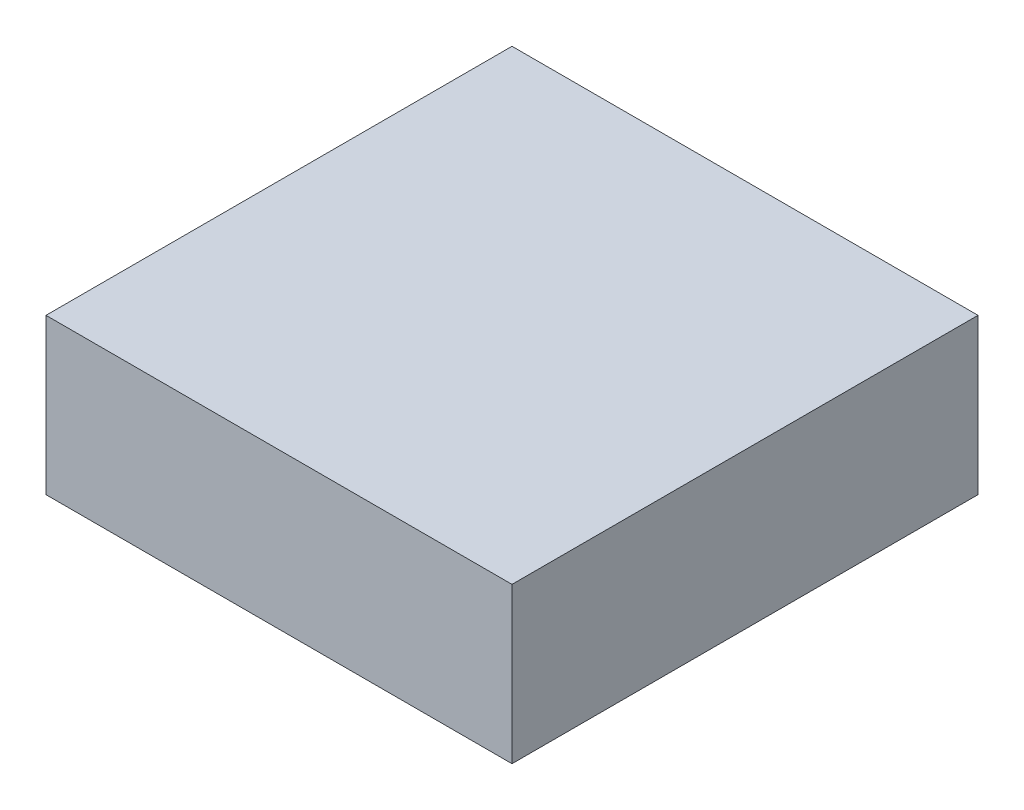
ISO-10303-21;
HEADER;
FILE_DESCRIPTION(('STEP AP214'),'2;1');
FILE_NAME('part.step','',(''),(''),'','','');
FILE_SCHEMA(('AUTOMOTIVE_DESIGN { 1 0 10303 214 1 1 1 1 }'));
ENDSEC;
DATA;
#1=APPLICATION_CONTEXT('core data for automotive mechanical design processes');
#2=APPLICATION_PROTOCOL_DEFINITION('international standard','automotive_design',2000,#1);
#3=PRODUCT_CONTEXT('',#1,'mechanical');
#4=PRODUCT('Part','Part','',(#3));
#5=PRODUCT_RELATED_PRODUCT_CATEGORY('part','',(#4));
#6=PRODUCT_DEFINITION_FORMATION('','',#4);
#7=PRODUCT_DEFINITION_CONTEXT('part definition',#1,'design');
#8=PRODUCT_DEFINITION('design','',#6,#7);
#9=PRODUCT_DEFINITION_SHAPE('','',#8);
#10=(LENGTH_UNIT() NAMED_UNIT(*) SI_UNIT(.MILLI.,.METRE.));
#11=(NAMED_UNIT(*) PLANE_ANGLE_UNIT() SI_UNIT($,.RADIAN.));
#12=(NAMED_UNIT(*) SI_UNIT($,.STERADIAN.) SOLID_ANGLE_UNIT());
#13=UNCERTAINTY_MEASURE_WITH_UNIT(LENGTH_MEASURE(1.E-05),#10,'distance_accuracy_value','');
#14=(GEOMETRIC_REPRESENTATION_CONTEXT(3) GLOBAL_UNCERTAINTY_ASSIGNED_CONTEXT((#13)) GLOBAL_UNIT_ASSIGNED_CONTEXT((#10,
#11,#12)) REPRESENTATION_CONTEXT('',''));
#15=CARTESIAN_POINT('',(0.,0.,0.));
#16=DIRECTION('',(0.,0.,1.));
#17=DIRECTION('',(1.,0.,0.));
#18=AXIS2_PLACEMENT_3D('',#15,#16,#17);
#19=CARTESIAN_POINT('',(-0.67499992,-0.22499828,0.));
#20=DIRECTION('',(0.,1.,0.));
#21=DIRECTION('',(1.,0.,0.));
#22=AXIS2_PLACEMENT_3D('',#19,#20,#21);
#23=PLANE('',#22);
#24=DIRECTION('',(1.,0.,0.));
#25=VECTOR('',#24,1.);
#26=CARTESIAN_POINT('',(-0.67499992,-0.22499828,0.));
#27=LINE('',#26,#25);
#28=CARTESIAN_POINT('',(-0.67499992,-0.22499828,0.));
#29=VERTEX_POINT('',#28);
#30=CARTESIAN_POINT('',(0.67499992,-0.22499828,0.));
#31=VERTEX_POINT('',#30);
#32=EDGE_CURVE('E11',#29,#31,#27,.T.);
#33=ORIENTED_EDGE('',*,*,#32,.T.);
#34=DIRECTION('',(0.,0.,1.));
#35=VECTOR('',#34,1.);
#36=CARTESIAN_POINT('',(0.67499992,-0.22499828,0.));
#37=LINE('',#36,#35);
#38=CARTESIAN_POINT('',(0.67499992,-0.22499828,1.34999984));
#39=VERTEX_POINT('',#38);
#40=EDGE_CURVE('E27',#31,#39,#37,.T.);
#41=ORIENTED_EDGE('',*,*,#40,.T.);
#42=DIRECTION('',(1.,0.,0.));
#43=VECTOR('',#42,1.);
#44=CARTESIAN_POINT('',(-0.67499992,-0.22499828,1.34999984));
#45=LINE('',#44,#43);
#46=CARTESIAN_POINT('',(-0.67499992,-0.22499828,1.34999984));
#47=VERTEX_POINT('',#46);
#48=EDGE_CURVE('E20',#47,#39,#45,.T.);
#49=ORIENTED_EDGE('',*,*,#48,.F.);
#50=DIRECTION('',(0.,0.,1.));
#51=VECTOR('',#50,1.);
#52=CARTESIAN_POINT('',(-0.67499992,-0.22499828,0.));
#53=LINE('',#52,#51);
#54=EDGE_CURVE('E77',#29,#47,#53,.T.);
#55=ORIENTED_EDGE('',*,*,#54,.F.);
#56=EDGE_LOOP('',(#33,#41,#49,#55));
#57=FACE_BOUND('',#56,.T.);
#58=ADVANCED_FACE('F17',(#57),#23,.F.);
#59=CARTESIAN_POINT('',(0.67499992,-0.22499828,0.));
#60=DIRECTION('',(-1.,0.,0.));
#61=DIRECTION('',(0.,0.,1.));
#62=AXIS2_PLACEMENT_3D('',#59,#60,#61);
#63=PLANE('',#62);
#64=DIRECTION('',(0.,1.,0.));
#65=VECTOR('',#64,1.);
#66=CARTESIAN_POINT('',(0.67499992,-0.22499828,0.));
#67=LINE('',#66,#65);
#68=CARTESIAN_POINT('',(0.67499992,0.22500082,0.));
#69=VERTEX_POINT('',#68);
#70=EDGE_CURVE('E104',#31,#69,#67,.T.);
#71=ORIENTED_EDGE('',*,*,#70,.T.);
#72=DIRECTION('',(0.,0.,1.));
#73=VECTOR('',#72,1.);
#74=CARTESIAN_POINT('',(0.67499992,0.22500082,0.));
#75=LINE('',#74,#73);
#76=CARTESIAN_POINT('',(0.67499992,0.22500082,1.34999984));
#77=VERTEX_POINT('',#76);
#78=EDGE_CURVE('E102',#69,#77,#75,.T.);
#79=ORIENTED_EDGE('',*,*,#78,.T.);
#80=DIRECTION('',(0.,1.,0.));
#81=VECTOR('',#80,1.);
#82=CARTESIAN_POINT('',(0.67499992,-0.22499828,1.34999984));
#83=LINE('',#82,#81);
#84=EDGE_CURVE('E53',#39,#77,#83,.T.);
#85=ORIENTED_EDGE('',*,*,#84,.F.);
#86=ORIENTED_EDGE('',*,*,#40,.F.);
#87=EDGE_LOOP('',(#71,#79,#85,#86));
#88=FACE_BOUND('',#87,.T.);
#89=ADVANCED_FACE('F123',(#88),#63,.F.);
#90=CARTESIAN_POINT('',(0.67499992,0.22500082,0.));
#91=DIRECTION('',(0.,-1.,0.));
#92=DIRECTION('',(0.,0.,-1.));
#93=AXIS2_PLACEMENT_3D('',#90,#91,#92);
#94=PLANE('',#93);
#95=DIRECTION('',(-1.,0.,0.));
#96=VECTOR('',#95,1.);
#97=CARTESIAN_POINT('',(0.67499992,0.22500082,0.));
#98=LINE('',#97,#96);
#99=CARTESIAN_POINT('',(-0.67499992,0.22500082,0.));
#100=VERTEX_POINT('',#99);
#101=EDGE_CURVE('E100',#69,#100,#98,.T.);
#102=ORIENTED_EDGE('',*,*,#101,.T.);
#103=DIRECTION('',(0.,0.,1.));
#104=VECTOR('',#103,1.);
#105=CARTESIAN_POINT('',(-0.67499992,0.22500082,0.));
#106=LINE('',#105,#104);
#107=CARTESIAN_POINT('',(-0.67499992,0.22500082,1.34999984));
#108=VERTEX_POINT('',#107);
#109=EDGE_CURVE('E68',#100,#108,#106,.T.);
#110=ORIENTED_EDGE('',*,*,#109,.T.);
#111=DIRECTION('',(-1.,0.,0.));
#112=VECTOR('',#111,1.);
#113=CARTESIAN_POINT('',(0.67499992,0.22500082,1.34999984));
#114=LINE('',#113,#112);
#115=EDGE_CURVE('E91',#77,#108,#114,.T.);
#116=ORIENTED_EDGE('',*,*,#115,.F.);
#117=ORIENTED_EDGE('',*,*,#78,.F.);
#118=EDGE_LOOP('',(#102,#110,#116,#117));
#119=FACE_BOUND('',#118,.T.);
#120=ADVANCED_FACE('F128',(#119),#94,.F.);
#121=CARTESIAN_POINT('',(-0.67499992,0.22500082,0.));
#122=DIRECTION('',(1.,0.,0.));
#123=DIRECTION('',(0.,1.,0.));
#124=AXIS2_PLACEMENT_3D('',#121,#122,#123);
#125=PLANE('',#124);
#126=DIRECTION('',(0.,-1.,0.));
#127=VECTOR('',#126,1.);
#128=CARTESIAN_POINT('',(-0.67499992,0.22500082,0.));
#129=LINE('',#128,#127);
#130=EDGE_CURVE('E86',#100,#29,#129,.T.);
#131=ORIENTED_EDGE('',*,*,#130,.T.);
#132=ORIENTED_EDGE('',*,*,#54,.T.);
#133=DIRECTION('',(0.,-1.,0.));
#134=VECTOR('',#133,1.);
#135=CARTESIAN_POINT('',(-0.67499992,0.22500082,1.34999984));
#136=LINE('',#135,#134);
#137=EDGE_CURVE('E84',#108,#47,#136,.T.);
#138=ORIENTED_EDGE('',*,*,#137,.F.);
#139=ORIENTED_EDGE('',*,*,#109,.F.);
#140=EDGE_LOOP('',(#131,#132,#138,#139));
#141=FACE_BOUND('',#140,.T.);
#142=ADVANCED_FACE('F83',(#141),#125,.F.);
#143=CARTESIAN_POINT('',(-0.67499992,-0.22499828,0.));
#144=DIRECTION('',(0.,0.,-1.));
#145=DIRECTION('',(0.,-1.,0.));
#146=AXIS2_PLACEMENT_3D('',#143,#144,#145);
#147=PLANE('',#146);
#148=ORIENTED_EDGE('',*,*,#130,.F.);
#149=ORIENTED_EDGE('',*,*,#101,.F.);
#150=ORIENTED_EDGE('',*,*,#70,.F.);
#151=ORIENTED_EDGE('',*,*,#32,.F.);
#152=EDGE_LOOP('',(#148,#149,#150,#151));
#153=FACE_BOUND('',#152,.T.);
#154=ADVANCED_FACE('F116',(#153),#147,.T.);
#155=CARTESIAN_POINT('',(-0.67499992,-0.22499828,1.34999984));
#156=DIRECTION('',(0.,0.,-1.));
#157=DIRECTION('',(0.,-1.,0.));
#158=AXIS2_PLACEMENT_3D('',#155,#156,#157);
#159=PLANE('',#158);
#160=ORIENTED_EDGE('',*,*,#48,.T.);
#161=ORIENTED_EDGE('',*,*,#84,.T.);
#162=ORIENTED_EDGE('',*,*,#115,.T.);
#163=ORIENTED_EDGE('',*,*,#137,.T.);
#164=EDGE_LOOP('',(#160,#161,#162,#163));
#165=FACE_BOUND('',#164,.T.);
#166=ADVANCED_FACE('F89',(#165),#159,.F.);
#167=CLOSED_SHELL('',(#58,#89,#120,#142,#154,#166));
#168=MANIFOLD_SOLID_BREP('B1',#167);
#169=ADVANCED_BREP_SHAPE_REPRESENTATION('',(#18,#168),#14);
#170=SHAPE_DEFINITION_REPRESENTATION(#9,#169);
ENDSEC;
END-ISO-10303-21;
